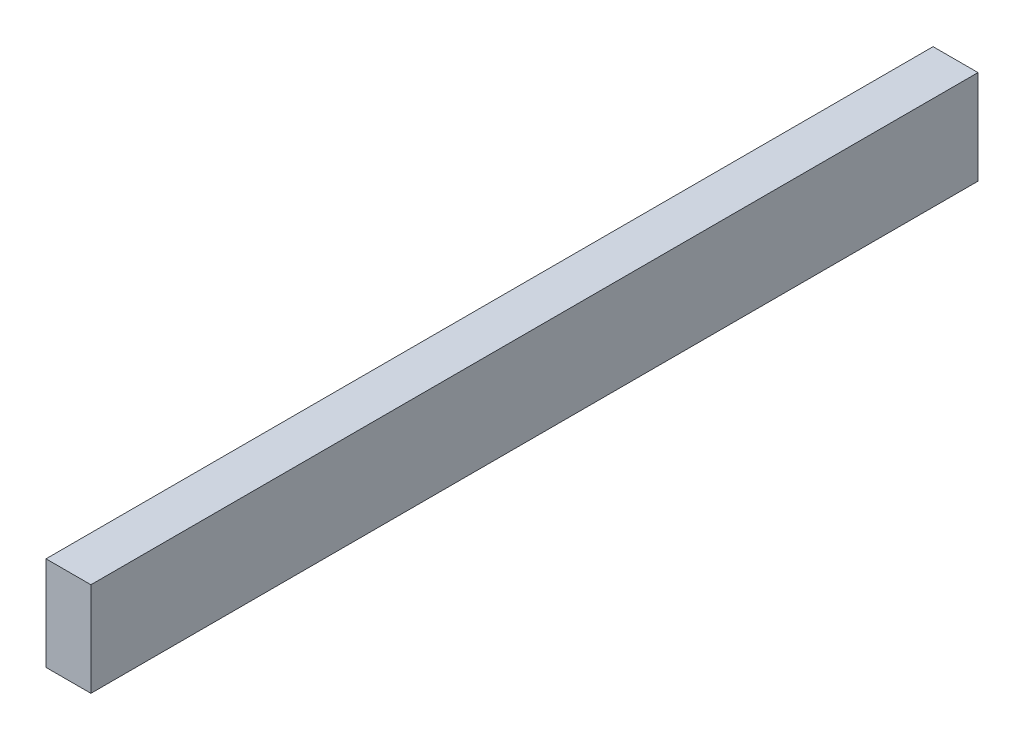
ISO-10303-21;
HEADER;
FILE_DESCRIPTION(('STEP AP214'),'2;1');
FILE_NAME('part.step','',(''),(''),'','','');
FILE_SCHEMA(('AUTOMOTIVE_DESIGN { 1 0 10303 214 1 1 1 1 }'));
ENDSEC;
DATA;
#1=APPLICATION_CONTEXT('core data for automotive mechanical design processes');
#2=APPLICATION_PROTOCOL_DEFINITION('international standard','automotive_design',2000,#1);
#3=PRODUCT_CONTEXT('',#1,'mechanical');
#4=PRODUCT('Part','Part','',(#3));
#5=PRODUCT_RELATED_PRODUCT_CATEGORY('part','',(#4));
#6=PRODUCT_DEFINITION_FORMATION('','',#4);
#7=PRODUCT_DEFINITION_CONTEXT('part definition',#1,'design');
#8=PRODUCT_DEFINITION('design','',#6,#7);
#9=PRODUCT_DEFINITION_SHAPE('','',#8);
#10=(LENGTH_UNIT() NAMED_UNIT(*) SI_UNIT(.MILLI.,.METRE.));
#11=(NAMED_UNIT(*) PLANE_ANGLE_UNIT() SI_UNIT($,.RADIAN.));
#12=(NAMED_UNIT(*) SI_UNIT($,.STERADIAN.) SOLID_ANGLE_UNIT());
#13=UNCERTAINTY_MEASURE_WITH_UNIT(LENGTH_MEASURE(1.E-05),#10,'distance_accuracy_value','');
#14=(GEOMETRIC_REPRESENTATION_CONTEXT(3) GLOBAL_UNCERTAINTY_ASSIGNED_CONTEXT((#13)) GLOBAL_UNIT_ASSIGNED_CONTEXT((#10,
#11,#12)) REPRESENTATION_CONTEXT('',''));
#15=CARTESIAN_POINT('',(0.,0.,0.));
#16=DIRECTION('',(0.,0.,1.));
#17=DIRECTION('',(1.,0.,0.));
#18=AXIS2_PLACEMENT_3D('',#15,#16,#17);
#19=CARTESIAN_POINT('',(-7.59316047953007,-1054.80105699373,700.));
#20=DIRECTION('',(1.,0.,0.));
#21=DIRECTION('',(0.,0.,-1.));
#22=AXIS2_PLACEMENT_3D('',#19,#20,#21);
#23=PLANE('',#22);
#24=DIRECTION('',(0.,-1.,0.));
#25=VECTOR('',#24,1.);
#26=CARTESIAN_POINT('',(-7.59316047953007,-1054.80105699373,400.));
#27=LINE('',#26,#25);
#28=CARTESIAN_POINT('',(-7.59316047953007,-533.338335189967,400.));
#29=VERTEX_POINT('',#28);
#30=CARTESIAN_POINT('',(-7.59316047953007,-565.151215093749,400.));
#31=VERTEX_POINT('',#30);
#32=EDGE_CURVE('E96',#29,#31,#27,.T.);
#33=ORIENTED_EDGE('',*,*,#32,.T.);
#34=DIRECTION('',(0.,0.,-1.));
#35=VECTOR('',#34,1.);
#36=CARTESIAN_POINT('',(-7.59316047953007,-565.151215093749,700.));
#37=LINE('',#36,#35);
#38=CARTESIAN_POINT('',(-7.59316047953007,-565.151215093749,700.));
#39=VERTEX_POINT('',#38);
#40=EDGE_CURVE('E11',#39,#31,#37,.T.);
#41=ORIENTED_EDGE('',*,*,#40,.F.);
#42=DIRECTION('',(0.,-1.,0.));
#43=VECTOR('',#42,1.);
#44=CARTESIAN_POINT('',(-7.59316047953007,-1054.80105699373,700.));
#45=LINE('',#44,#43);
#46=CARTESIAN_POINT('',(-7.59316047953007,-533.338335189967,700.));
#47=VERTEX_POINT('',#46);
#48=EDGE_CURVE('E82',#47,#39,#45,.T.);
#49=ORIENTED_EDGE('',*,*,#48,.F.);
#50=DIRECTION('',(0.,0.,-1.));
#51=VECTOR('',#50,1.);
#52=CARTESIAN_POINT('',(-7.59316047953007,-533.338335189967,700.));
#53=LINE('',#52,#51);
#54=EDGE_CURVE('E49',#47,#29,#53,.T.);
#55=ORIENTED_EDGE('',*,*,#54,.T.);
#56=EDGE_LOOP('',(#33,#41,#49,#55));
#57=FACE_BOUND('',#56,.T.);
#58=ADVANCED_FACE('F33',(#57),#23,.F.);
#59=CARTESIAN_POINT('',(0.,-565.151215093749,700.));
#60=DIRECTION('',(0.,1.,0.));
#61=DIRECTION('',(0.,0.,1.));
#62=AXIS2_PLACEMENT_3D('',#59,#60,#61);
#63=PLANE('',#62);
#64=DIRECTION('',(1.,0.,0.));
#65=VECTOR('',#64,1.);
#66=CARTESIAN_POINT('',(0.,-565.151215093749,400.));
#67=LINE('',#66,#65);
#68=CARTESIAN_POINT('',(7.59316047953007,-565.151215093749,400.));
#69=VERTEX_POINT('',#68);
#70=EDGE_CURVE('E87',#31,#69,#67,.T.);
#71=ORIENTED_EDGE('',*,*,#70,.T.);
#72=DIRECTION('',(0.,0.,-1.));
#73=VECTOR('',#72,1.);
#74=CARTESIAN_POINT('',(7.59316047953007,-565.151215093749,700.));
#75=LINE('',#74,#73);
#76=CARTESIAN_POINT('',(7.59316047953007,-565.151215093749,700.));
#77=VERTEX_POINT('',#76);
#78=EDGE_CURVE('E41',#77,#69,#75,.T.);
#79=ORIENTED_EDGE('',*,*,#78,.F.);
#80=DIRECTION('',(1.,0.,0.));
#81=VECTOR('',#80,1.);
#82=CARTESIAN_POINT('',(0.,-565.151215093749,700.));
#83=LINE('',#82,#81);
#84=EDGE_CURVE('E74',#39,#77,#83,.T.);
#85=ORIENTED_EDGE('',*,*,#84,.F.);
#86=ORIENTED_EDGE('',*,*,#40,.T.);
#87=EDGE_LOOP('',(#71,#79,#85,#86));
#88=FACE_BOUND('',#87,.T.);
#89=ADVANCED_FACE('F86',(#88),#63,.F.);
#90=CARTESIAN_POINT('',(7.59316047953007,-1054.80105699373,700.));
#91=DIRECTION('',(1.,0.,0.));
#92=DIRECTION('',(0.,0.,-1.));
#93=AXIS2_PLACEMENT_3D('',#90,#91,#92);
#94=PLANE('',#93);
#95=DIRECTION('',(0.,-1.,0.));
#96=VECTOR('',#95,1.);
#97=CARTESIAN_POINT('',(7.59316047953007,-1054.80105699373,400.));
#98=LINE('',#97,#96);
#99=CARTESIAN_POINT('',(7.59316047953007,-533.338335189967,400.));
#100=VERTEX_POINT('',#99);
#101=EDGE_CURVE('E99',#100,#69,#98,.T.);
#102=ORIENTED_EDGE('',*,*,#101,.F.);
#103=DIRECTION('',(0.,0.,-1.));
#104=VECTOR('',#103,1.);
#105=CARTESIAN_POINT('',(7.59316047953007,-533.338335189967,700.));
#106=LINE('',#105,#104);
#107=CARTESIAN_POINT('',(7.59316047953007,-533.338335189967,700.));
#108=VERTEX_POINT('',#107);
#109=EDGE_CURVE('E63',#108,#100,#106,.T.);
#110=ORIENTED_EDGE('',*,*,#109,.F.);
#111=DIRECTION('',(0.,-1.,0.));
#112=VECTOR('',#111,1.);
#113=CARTESIAN_POINT('',(7.59316047953007,-1054.80105699373,700.));
#114=LINE('',#113,#112);
#115=EDGE_CURVE('E81',#108,#77,#114,.T.);
#116=ORIENTED_EDGE('',*,*,#115,.T.);
#117=ORIENTED_EDGE('',*,*,#78,.T.);
#118=EDGE_LOOP('',(#102,#110,#116,#117));
#119=FACE_BOUND('',#118,.T.);
#120=ADVANCED_FACE('F90',(#119),#94,.T.);
#121=CARTESIAN_POINT('',(0.,-533.338335189967,700.));
#122=DIRECTION('',(0.,1.,0.));
#123=DIRECTION('',(0.,0.,1.));
#124=AXIS2_PLACEMENT_3D('',#121,#122,#123);
#125=PLANE('',#124);
#126=DIRECTION('',(1.,0.,0.));
#127=VECTOR('',#126,1.);
#128=CARTESIAN_POINT('',(0.,-533.338335189967,400.));
#129=LINE('',#128,#127);
#130=EDGE_CURVE('E101',#29,#100,#129,.T.);
#131=ORIENTED_EDGE('',*,*,#130,.F.);
#132=ORIENTED_EDGE('',*,*,#54,.F.);
#133=DIRECTION('',(1.,0.,0.));
#134=VECTOR('',#133,1.);
#135=CARTESIAN_POINT('',(0.,-533.338335189967,700.));
#136=LINE('',#135,#134);
#137=EDGE_CURVE('E91',#47,#108,#136,.T.);
#138=ORIENTED_EDGE('',*,*,#137,.T.);
#139=ORIENTED_EDGE('',*,*,#109,.T.);
#140=EDGE_LOOP('',(#131,#132,#138,#139));
#141=FACE_BOUND('',#140,.T.);
#142=ADVANCED_FACE('F107',(#141),#125,.T.);
#143=CARTESIAN_POINT('',(0.,-1054.80105699373,700.));
#144=DIRECTION('',(0.,0.,1.));
#145=DIRECTION('',(1.,0.,0.));
#146=AXIS2_PLACEMENT_3D('',#143,#144,#145);
#147=PLANE('',#146);
#148=ORIENTED_EDGE('',*,*,#48,.T.);
#149=ORIENTED_EDGE('',*,*,#84,.T.);
#150=ORIENTED_EDGE('',*,*,#115,.F.);
#151=ORIENTED_EDGE('',*,*,#137,.F.);
#152=EDGE_LOOP('',(#148,#149,#150,#151));
#153=FACE_BOUND('',#152,.T.);
#154=ADVANCED_FACE('F78',(#153),#147,.T.);
#155=CARTESIAN_POINT('',(0.,-1054.80105699373,400.));
#156=DIRECTION('',(0.,0.,1.));
#157=DIRECTION('',(1.,0.,0.));
#158=AXIS2_PLACEMENT_3D('',#155,#156,#157);
#159=PLANE('',#158);
#160=ORIENTED_EDGE('',*,*,#32,.F.);
#161=ORIENTED_EDGE('',*,*,#130,.T.);
#162=ORIENTED_EDGE('',*,*,#101,.T.);
#163=ORIENTED_EDGE('',*,*,#70,.F.);
#164=EDGE_LOOP('',(#160,#161,#162,#163));
#165=FACE_BOUND('',#164,.T.);
#166=ADVANCED_FACE('F106',(#165),#159,.F.);
#167=CLOSED_SHELL('',(#58,#89,#120,#142,#154,#166));
#168=MANIFOLD_SOLID_BREP('B2',#167);
#169=ADVANCED_BREP_SHAPE_REPRESENTATION('',(#18,#168),#14);
#170=SHAPE_DEFINITION_REPRESENTATION(#9,#169);
ENDSEC;
END-ISO-10303-21;
